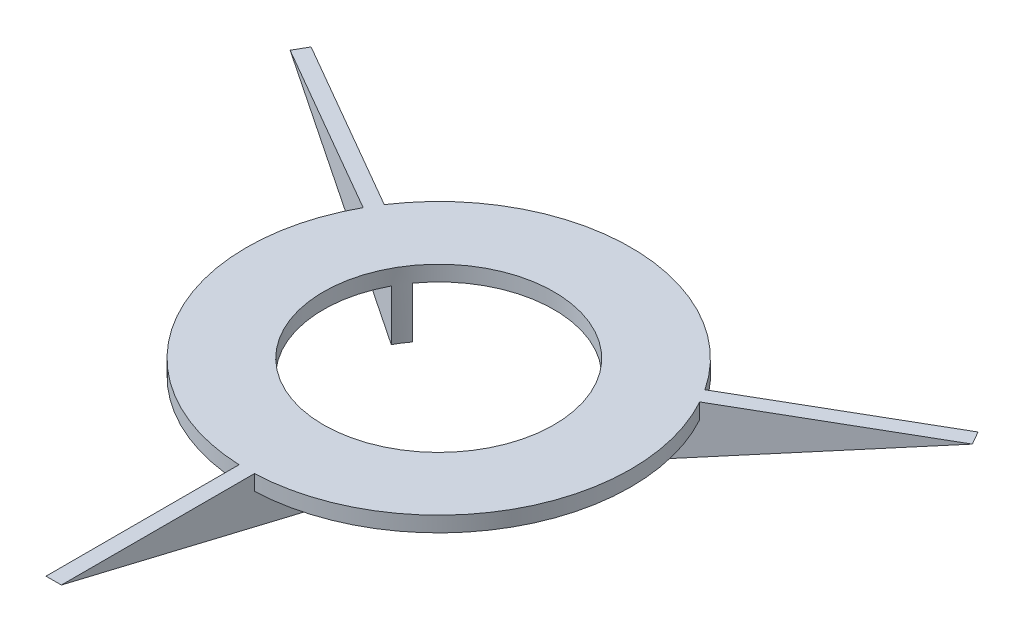
ISO-10303-21;
HEADER;
FILE_DESCRIPTION(('STEP AP214'),'2;1');
FILE_NAME('part.step','',(''),(''),'','','');
FILE_SCHEMA(('AUTOMOTIVE_DESIGN { 1 0 10303 214 1 1 1 1 }'));
ENDSEC;
DATA;
#1=APPLICATION_CONTEXT('core data for automotive mechanical design processes');
#2=APPLICATION_PROTOCOL_DEFINITION('international standard','automotive_design',2000,#1);
#3=PRODUCT_CONTEXT('',#1,'mechanical');
#4=PRODUCT('Part','Part','',(#3));
#5=PRODUCT_RELATED_PRODUCT_CATEGORY('part','',(#4));
#6=PRODUCT_DEFINITION_FORMATION('','',#4);
#7=PRODUCT_DEFINITION_CONTEXT('part definition',#1,'design');
#8=PRODUCT_DEFINITION('design','',#6,#7);
#9=PRODUCT_DEFINITION_SHAPE('','',#8);
#10=(LENGTH_UNIT() NAMED_UNIT(*) SI_UNIT(.MILLI.,.METRE.));
#11=(NAMED_UNIT(*) PLANE_ANGLE_UNIT() SI_UNIT($,.RADIAN.));
#12=(NAMED_UNIT(*) SI_UNIT($,.STERADIAN.) SOLID_ANGLE_UNIT());
#13=UNCERTAINTY_MEASURE_WITH_UNIT(LENGTH_MEASURE(1.E-05),#10,'distance_accuracy_value','');
#14=(GEOMETRIC_REPRESENTATION_CONTEXT(3) GLOBAL_UNCERTAINTY_ASSIGNED_CONTEXT((#13)) GLOBAL_UNIT_ASSIGNED_CONTEXT((#10,
#11,#12)) REPRESENTATION_CONTEXT('',''));
#15=CARTESIAN_POINT('',(0.,0.,0.));
#16=DIRECTION('',(0.,0.,1.));
#17=DIRECTION('',(1.,0.,0.));
#18=AXIS2_PLACEMENT_3D('',#15,#16,#17);
#19=CARTESIAN_POINT('',(0.,15.24,0.));
#20=DIRECTION('',(0.,-1.,0.));
#21=DIRECTION('',(0.,0.,-1.));
#22=AXIS2_PLACEMENT_3D('',#19,#20,#21);
#23=PLANE('',#22);
#24=DIRECTION('',(-0.866025403784443,0.,-0.499999999999992));
#25=VECTOR('',#24,1.);
#26=CARTESIAN_POINT('',(-1.26999999999999,15.24,0.));
#27=LINE('',#26,#25);
#28=CARTESIAN_POINT('',(-27.8083067588059,15.24,-15.3218985510331));
#29=VERTEX_POINT('',#28);
#30=CARTESIAN_POINT('',(-56.3725983665928,15.24,-31.8134999999995));
#31=VERTEX_POINT('',#30);
#32=EDGE_CURVE('E208',#29,#31,#27,.T.);
#33=ORIENTED_EDGE('',*,*,#32,.F.);
#34=CARTESIAN_POINT('',(0.,15.24,0.));
#35=DIRECTION('',(0.,1.,0.));
#36=DIRECTION('',(0.,0.,1.));
#37=AXIS2_PLACEMENT_3D('',#34,#35,#36);
#38=CIRCLE('',#37,31.75);
#39=CARTESIAN_POINT('',(-1.27,15.24,31.7245898318639));
#40=VERTEX_POINT('',#39);
#41=EDGE_CURVE('E164',#29,#40,#38,.T.);
#42=ORIENTED_EDGE('',*,*,#41,.T.);
#43=DIRECTION('',(0.,0.,1.));
#44=VECTOR('',#43,1.);
#45=CARTESIAN_POINT('',(-1.27,15.24,0.));
#46=LINE('',#45,#44);
#47=CARTESIAN_POINT('',(-1.27,15.24,63.627));
#48=VERTEX_POINT('',#47);
#49=EDGE_CURVE('E230',#40,#48,#46,.T.);
#50=ORIENTED_EDGE('',*,*,#49,.T.);
#51=DIRECTION('',(-1.,0.,0.));
#52=VECTOR('',#51,1.);
#53=CARTESIAN_POINT('',(1.27,15.24,63.627));
#54=LINE('',#53,#52);
#55=CARTESIAN_POINT('',(1.27,15.24,63.627));
#56=VERTEX_POINT('',#55);
#57=EDGE_CURVE('E235',#56,#48,#54,.T.);
#58=ORIENTED_EDGE('',*,*,#57,.F.);
#59=DIRECTION('',(0.,0.,1.));
#60=VECTOR('',#59,1.);
#61=CARTESIAN_POINT('',(1.27,15.24,0.));
#62=LINE('',#61,#60);
#63=CARTESIAN_POINT('',(1.27,15.24,31.7245898318639));
#64=VERTEX_POINT('',#63);
#65=EDGE_CURVE('E231',#64,#56,#62,.T.);
#66=ORIENTED_EDGE('',*,*,#65,.F.);
#67=CARTESIAN_POINT('',(27.8083067588057,15.24,-15.3218985510335));
#68=VERTEX_POINT('',#67);
#69=EDGE_CURVE('E171',#64,#68,#38,.T.);
#70=ORIENTED_EDGE('',*,*,#69,.T.);
#71=DIRECTION('',(0.866025403784436,0.,-0.500000000000004));
#72=VECTOR('',#71,1.);
#73=CARTESIAN_POINT('',(1.27,15.24,0.));
#74=LINE('',#73,#72);
#75=CARTESIAN_POINT('',(56.3725983665923,15.24,-31.8135000000003));
#76=VERTEX_POINT('',#75);
#77=EDGE_CURVE('E216',#68,#76,#74,.T.);
#78=ORIENTED_EDGE('',*,*,#77,.T.);
#79=DIRECTION('',(0.500000000000004,0.,0.866025403784436));
#80=VECTOR('',#79,1.);
#81=CARTESIAN_POINT('',(55.1025983665923,15.24,-34.0132045256127));
#82=LINE('',#81,#80);
#83=CARTESIAN_POINT('',(55.1025983665923,15.24,-34.0132045256127));
#84=VERTEX_POINT('',#83);
#85=EDGE_CURVE('E224',#84,#76,#82,.T.);
#86=ORIENTED_EDGE('',*,*,#85,.F.);
#87=DIRECTION('',(0.866025403784436,0.,-0.500000000000004));
#88=VECTOR('',#87,1.);
#89=CARTESIAN_POINT('',(0.,15.24,-2.19970452561247));
#90=LINE('',#89,#88);
#91=CARTESIAN_POINT('',(26.4942685939528,15.24,-17.4961776303136));
#92=VERTEX_POINT('',#91);
#93=EDGE_CURVE('E218',#92,#84,#90,.T.);
#94=ORIENTED_EDGE('',*,*,#93,.F.);
#95=CARTESIAN_POINT('',(-26.4942685939531,15.24,-17.4961776303132));
#96=VERTEX_POINT('',#95);
#97=EDGE_CURVE('E169',#92,#96,#38,.T.);
#98=ORIENTED_EDGE('',*,*,#97,.T.);
#99=DIRECTION('',(-0.866025403784443,0.,-0.499999999999992));
#100=VECTOR('',#99,1.);
#101=CARTESIAN_POINT('',(0.,15.24,-2.19970452561247));
#102=LINE('',#101,#100);
#103=CARTESIAN_POINT('',(-55.1025983665928,15.24,-34.013204525612));
#104=VERTEX_POINT('',#103);
#105=EDGE_CURVE('E204',#96,#104,#102,.T.);
#106=ORIENTED_EDGE('',*,*,#105,.T.);
#107=DIRECTION('',(0.499999999999992,0.,-0.866025403784443));
#108=VECTOR('',#107,1.);
#109=CARTESIAN_POINT('',(-56.3725983665928,15.24,-31.8134999999995));
#110=LINE('',#109,#108);
#111=EDGE_CURVE('E205',#31,#104,#110,.T.);
#112=ORIENTED_EDGE('',*,*,#111,.F.);
#113=EDGE_LOOP('',(#33,#42,#50,#58,#66,#70,#78,#86,#94,#98,#106,#112));
#114=FACE_BOUND('',#113,.T.);
#115=CARTESIAN_POINT('',(0.,15.24,0.));
#116=DIRECTION('',(0.,1.,0.));
#117=DIRECTION('',(0.,0.,1.));
#118=AXIS2_PLACEMENT_3D('',#115,#116,#117);
#119=CIRCLE('',#118,19.05);
#120=CARTESIAN_POINT('',(0.,15.24,19.05));
#121=VERTEX_POINT('',#120);
#122=EDGE_CURVE('E147',#121,#121,#119,.T.);
#123=ORIENTED_EDGE('',*,*,#122,.F.);
#124=EDGE_LOOP('',(#123));
#125=FACE_BOUND('',#124,.T.);
#126=ADVANCED_FACE('F39',(#114,#125),#23,.F.);
#127=CARTESIAN_POINT('',(1.27,15.24,63.627));
#128=DIRECTION('',(0.,0.972492920409641,-0.232932436026261));
#129=DIRECTION('',(0.,0.232932436026261,0.972492920409641));
#130=AXIS2_PLACEMENT_3D('',#127,#128,#129);
#131=PLANE('',#130);
#132=DIRECTION('',(0.,-0.232932436026261,-0.972492920409641));
#133=VECTOR('',#132,1.);
#134=CARTESIAN_POINT('',(-1.27,15.24,63.627));
#135=LINE('',#134,#133);
#136=CARTESIAN_POINT('',(-1.27,4.55272323947583,19.0076195248116));
#137=VERTEX_POINT('',#136);
#138=EDGE_CURVE('E233',#48,#137,#135,.T.);
#139=ORIENTED_EDGE('',*,*,#138,.T.);
#140=CARTESIAN_POINT('',(0.,0.,0.));
#141=DIRECTION('',(0.,0.972492920409641,-0.232932436026261));
#142=DIRECTION('',(0.,0.232932436026261,0.972492920409641));
#143=AXIS2_PLACEMENT_3D('',#140,#141,#142);
#144=ELLIPSE('',#143,19.5888315484864,19.05);
#145=CARTESIAN_POINT('',(1.27,4.55272323947584,19.0076195248116));
#146=VERTEX_POINT('',#145);
#147=EDGE_CURVE('E148',#137,#146,#144,.T.);
#148=ORIENTED_EDGE('',*,*,#147,.T.);
#149=DIRECTION('',(0.,-0.232932436026261,-0.972492920409641));
#150=VECTOR('',#149,1.);
#151=CARTESIAN_POINT('',(1.27,15.24,63.627));
#152=LINE('',#151,#150);
#153=EDGE_CURVE('E143',#56,#146,#152,.T.);
#154=ORIENTED_EDGE('',*,*,#153,.F.);
#155=ORIENTED_EDGE('',*,*,#57,.T.);
#156=EDGE_LOOP('',(#139,#148,#154,#155));
#157=FACE_BOUND('',#156,.T.);
#158=ADVANCED_FACE('F275',(#157),#131,.F.);
#159=CARTESIAN_POINT('',(1.27,0.,0.));
#160=DIRECTION('',(-1.,0.,0.));
#161=DIRECTION('',(0.,0.,1.));
#162=AXIS2_PLACEMENT_3D('',#159,#160,#161);
#163=PLANE('',#162);
#164=ORIENTED_EDGE('',*,*,#153,.T.);
#165=DIRECTION('',(0.,1.,0.));
#166=VECTOR('',#165,1.);
#167=CARTESIAN_POINT('',(1.27,0.,19.0076195248116));
#168=LINE('',#167,#166);
#169=CARTESIAN_POINT('',(1.27,12.7,19.0076195248116));
#170=VERTEX_POINT('',#169);
#171=EDGE_CURVE('E140',#146,#170,#168,.T.);
#172=ORIENTED_EDGE('',*,*,#171,.T.);
#173=DIRECTION('',(0.,0.,-1.));
#174=VECTOR('',#173,1.);
#175=CARTESIAN_POINT('',(1.27,12.7,0.));
#176=LINE('',#175,#174);
#177=CARTESIAN_POINT('',(1.27,12.7,31.7245898318639));
#178=VERTEX_POINT('',#177);
#179=EDGE_CURVE('E53',#178,#170,#176,.T.);
#180=ORIENTED_EDGE('',*,*,#179,.F.);
#181=DIRECTION('',(0.,1.,0.));
#182=VECTOR('',#181,1.);
#183=CARTESIAN_POINT('',(1.27,12.7,31.7245898318639));
#184=LINE('',#183,#182);
#185=EDGE_CURVE('E57',#178,#64,#184,.T.);
#186=ORIENTED_EDGE('',*,*,#185,.T.);
#187=ORIENTED_EDGE('',*,*,#65,.T.);
#188=EDGE_LOOP('',(#164,#172,#180,#186,#187));
#189=FACE_BOUND('',#188,.T.);
#190=ADVANCED_FACE('F141',(#189),#163,.F.);
#191=CARTESIAN_POINT('',(-1.27,0.,0.));
#192=DIRECTION('',(-1.,0.,0.));
#193=DIRECTION('',(0.,0.,1.));
#194=AXIS2_PLACEMENT_3D('',#191,#192,#193);
#195=PLANE('',#194);
#196=DIRECTION('',(0.,1.,0.));
#197=VECTOR('',#196,1.);
#198=CARTESIAN_POINT('',(-1.27,0.,19.0076195248116));
#199=LINE('',#198,#197);
#200=CARTESIAN_POINT('',(-1.27,12.7,19.0076195248116));
#201=VERTEX_POINT('',#200);
#202=EDGE_CURVE('E276',#137,#201,#199,.T.);
#203=ORIENTED_EDGE('',*,*,#202,.F.);
#204=ORIENTED_EDGE('',*,*,#138,.F.);
#205=ORIENTED_EDGE('',*,*,#49,.F.);
#206=DIRECTION('',(0.,1.,0.));
#207=VECTOR('',#206,1.);
#208=CARTESIAN_POINT('',(-1.27,12.7,31.7245898318639));
#209=LINE('',#208,#207);
#210=CARTESIAN_POINT('',(-1.27,12.7,31.7245898318639));
#211=VERTEX_POINT('',#210);
#212=EDGE_CURVE('E201',#211,#40,#209,.T.);
#213=ORIENTED_EDGE('',*,*,#212,.F.);
#214=DIRECTION('',(0.,0.,-1.));
#215=VECTOR('',#214,1.);
#216=CARTESIAN_POINT('',(-1.27,12.7,0.));
#217=LINE('',#216,#215);
#218=EDGE_CURVE('E159',#211,#201,#217,.T.);
#219=ORIENTED_EDGE('',*,*,#218,.T.);
#220=EDGE_LOOP('',(#203,#204,#205,#213,#219));
#221=FACE_BOUND('',#220,.T.);
#222=ADVANCED_FACE('F268',(#221),#195,.T.);
#223=CARTESIAN_POINT('',(55.1025983665923,15.24,-34.0132045256127));
#224=DIRECTION('',(-0.201725406964135,0.972492920409641,0.116466218013131));
#225=DIRECTION('',(-0.979156418960265,-0.203107624694176,0.));
#226=AXIS2_PLACEMENT_3D('',#223,#224,#225);
#227=PLANE('',#226);
#228=DIRECTION('',(-0.842203574075265,-0.232932436026261,0.486246460204824));
#229=VECTOR('',#228,1.);
#230=CARTESIAN_POINT('',(56.3725983665923,15.24,-31.8135000000003));
#231=LINE('',#230,#229);
#232=CARTESIAN_POINT('',(16.8061159592004,4.29690094908053,-8.9697807312057));
#233=VERTEX_POINT('',#232);
#234=EDGE_CURVE('E221',#76,#233,#231,.T.);
#235=ORIENTED_EDGE('',*,*,#234,.T.);
#236=CARTESIAN_POINT('',(0.,-0.26343766773802,0.));
#237=DIRECTION('',(-0.201725406964135,0.972492920409641,0.116466218013131));
#238=DIRECTION('',(0.842203574075265,0.232932436026261,-0.486246460204824));
#239=AXIS2_PLACEMENT_3D('',#236,#237,#238);
#240=ELLIPSE('',#239,19.5888315484864,19.05);
#241=CARTESIAN_POINT('',(15.4625877624823,4.27656488959876,-11.12703373265));
#242=VERTEX_POINT('',#241);
#243=EDGE_CURVE('E280',#233,#242,#240,.T.);
#244=ORIENTED_EDGE('',*,*,#243,.T.);
#245=DIRECTION('',(-0.842203574075265,-0.232932436026261,0.486246460204824));
#246=VECTOR('',#245,1.);
#247=CARTESIAN_POINT('',(55.1025983665923,15.24,-34.0132045256127));
#248=LINE('',#247,#246);
#249=EDGE_CURVE('E220',#84,#242,#248,.T.);
#250=ORIENTED_EDGE('',*,*,#249,.F.);
#251=ORIENTED_EDGE('',*,*,#85,.T.);
#252=EDGE_LOOP('',(#235,#244,#250,#251));
#253=FACE_BOUND('',#252,.T.);
#254=ADVANCED_FACE('F315',(#253),#227,.F.);
#255=CARTESIAN_POINT('',(0.,0.,-2.19970452561247));
#256=DIRECTION('',(0.500000000000004,0.,0.866025403784436));
#257=DIRECTION('',(0.866025403784436,0.,-0.500000000000004));
#258=AXIS2_PLACEMENT_3D('',#255,#256,#257);
#259=PLANE('',#258);
#260=ORIENTED_EDGE('',*,*,#249,.T.);
#261=DIRECTION('',(0.,1.,0.));
#262=VECTOR('',#261,1.);
#263=CARTESIAN_POINT('',(15.4625877624824,0.,-11.12703373265));
#264=LINE('',#263,#262);
#265=CARTESIAN_POINT('',(15.4625877624824,12.7,-11.12703373265));
#266=VERTEX_POINT('',#265);
#267=EDGE_CURVE('E277',#242,#266,#264,.T.);
#268=ORIENTED_EDGE('',*,*,#267,.T.);
#269=DIRECTION('',(-0.866025403784436,0.,0.500000000000004));
#270=VECTOR('',#269,1.);
#271=CARTESIAN_POINT('',(0.,12.7,-2.19970452561247));
#272=LINE('',#271,#270);
#273=CARTESIAN_POINT('',(26.4942685939528,12.7,-17.4961776303136));
#274=VERTEX_POINT('',#273);
#275=EDGE_CURVE('E192',#274,#266,#272,.T.);
#276=ORIENTED_EDGE('',*,*,#275,.F.);
#277=DIRECTION('',(0.,1.,0.));
#278=VECTOR('',#277,1.);
#279=CARTESIAN_POINT('',(26.4942685939528,12.7,-17.4961776303136));
#280=LINE('',#279,#278);
#281=EDGE_CURVE('E199',#274,#92,#280,.T.);
#282=ORIENTED_EDGE('',*,*,#281,.T.);
#283=ORIENTED_EDGE('',*,*,#93,.T.);
#284=EDGE_LOOP('',(#260,#268,#276,#282,#283));
#285=FACE_BOUND('',#284,.T.);
#286=ADVANCED_FACE('F319',(#285),#259,.F.);
#287=CARTESIAN_POINT('',(1.27,0.,0.));
#288=DIRECTION('',(0.500000000000004,0.,0.866025403784436));
#289=DIRECTION('',(0.866025403784436,0.,-0.500000000000004));
#290=AXIS2_PLACEMENT_3D('',#287,#288,#289);
#291=PLANE('',#290);
#292=DIRECTION('',(0.,1.,0.));
#293=VECTOR('',#292,1.);
#294=CARTESIAN_POINT('',(16.8061159592004,0.,-8.9697807312057));
#295=LINE('',#294,#293);
#296=CARTESIAN_POINT('',(16.8061159592004,12.7,-8.9697807312057));
#297=VERTEX_POINT('',#296);
#298=EDGE_CURVE('E163',#233,#297,#295,.T.);
#299=ORIENTED_EDGE('',*,*,#298,.F.);
#300=ORIENTED_EDGE('',*,*,#234,.F.);
#301=ORIENTED_EDGE('',*,*,#77,.F.);
#302=DIRECTION('',(0.,1.,0.));
#303=VECTOR('',#302,1.);
#304=CARTESIAN_POINT('',(27.8083067588057,12.7,-15.3218985510335));
#305=LINE('',#304,#303);
#306=CARTESIAN_POINT('',(27.8083067588057,12.7,-15.3218985510335));
#307=VERTEX_POINT('',#306);
#308=EDGE_CURVE('E197',#307,#68,#305,.T.);
#309=ORIENTED_EDGE('',*,*,#308,.F.);
#310=DIRECTION('',(-0.866025403784436,0.,0.500000000000004));
#311=VECTOR('',#310,1.);
#312=CARTESIAN_POINT('',(1.27,12.7,0.));
#313=LINE('',#312,#311);
#314=EDGE_CURVE('E190',#307,#297,#313,.T.);
#315=ORIENTED_EDGE('',*,*,#314,.T.);
#316=EDGE_LOOP('',(#299,#300,#301,#309,#315));
#317=FACE_BOUND('',#316,.T.);
#318=ADVANCED_FACE('F321',(#317),#291,.T.);
#319=CARTESIAN_POINT('',(-56.3725983665928,15.24,-31.8134999999995));
#320=DIRECTION('',(0.201725406964137,0.972492920409641,0.116466218013129));
#321=DIRECTION('',(-0.979156418960265,0.203107624694178,0.));
#322=AXIS2_PLACEMENT_3D('',#319,#320,#321);
#323=PLANE('',#322);
#324=DIRECTION('',(0.842203574075272,-0.232932436026261,0.486246460204813));
#325=VECTOR('',#324,1.);
#326=CARTESIAN_POINT('',(-55.1025983665928,15.24,-34.013204525612));
#327=LINE('',#326,#325);
#328=CARTESIAN_POINT('',(-15.4625877624825,4.27656488959877,-11.1270337326498));
#329=VERTEX_POINT('',#328);
#330=EDGE_CURVE('E209',#104,#329,#327,.T.);
#331=ORIENTED_EDGE('',*,*,#330,.T.);
#332=CARTESIAN_POINT('',(0.,-0.263437667738016,0.));
#333=DIRECTION('',(0.201725406964137,0.972492920409641,0.116466218013129));
#334=DIRECTION('',(-0.842203574075272,0.232932436026261,-0.486246460204813));
#335=AXIS2_PLACEMENT_3D('',#332,#333,#334);
#336=ELLIPSE('',#335,19.5888315484864,19.05);
#337=CARTESIAN_POINT('',(-16.8061159592006,4.29690094908054,-8.96978073120548));
#338=VERTEX_POINT('',#337);
#339=EDGE_CURVE('E283',#329,#338,#336,.T.);
#340=ORIENTED_EDGE('',*,*,#339,.T.);
#341=DIRECTION('',(0.842203574075272,-0.232932436026261,0.486246460204813));
#342=VECTOR('',#341,1.);
#343=CARTESIAN_POINT('',(-56.3725983665928,15.24,-31.8134999999995));
#344=LINE('',#343,#342);
#345=EDGE_CURVE('E213',#31,#338,#344,.T.);
#346=ORIENTED_EDGE('',*,*,#345,.F.);
#347=ORIENTED_EDGE('',*,*,#111,.T.);
#348=EDGE_LOOP('',(#331,#340,#346,#347));
#349=FACE_BOUND('',#348,.T.);
#350=ADVANCED_FACE('F324',(#349),#323,.F.);
#351=CARTESIAN_POINT('',(-1.26999999999999,0.,0.));
#352=DIRECTION('',(0.499999999999992,0.,-0.866025403784443));
#353=DIRECTION('',(-0.866025403784443,0.,-0.499999999999992));
#354=AXIS2_PLACEMENT_3D('',#351,#352,#353);
#355=PLANE('',#354);
#356=ORIENTED_EDGE('',*,*,#345,.T.);
#357=DIRECTION('',(0.,1.,0.));
#358=VECTOR('',#357,1.);
#359=CARTESIAN_POINT('',(-16.8061159592005,0.,-8.96978073120547));
#360=LINE('',#359,#358);
#361=CARTESIAN_POINT('',(-16.8061159592005,12.7,-8.96978073120547));
#362=VERTEX_POINT('',#361);
#363=EDGE_CURVE('E286',#338,#362,#360,.T.);
#364=ORIENTED_EDGE('',*,*,#363,.T.);
#365=DIRECTION('',(0.866025403784443,0.,0.499999999999992));
#366=VECTOR('',#365,1.);
#367=CARTESIAN_POINT('',(-1.26999999999999,12.7,0.));
#368=LINE('',#367,#366);
#369=CARTESIAN_POINT('',(-27.8083067588059,12.7,-15.3218985510331));
#370=VERTEX_POINT('',#369);
#371=EDGE_CURVE('E184',#370,#362,#368,.T.);
#372=ORIENTED_EDGE('',*,*,#371,.F.);
#373=DIRECTION('',(0.,1.,0.));
#374=VECTOR('',#373,1.);
#375=CARTESIAN_POINT('',(-27.8083067588059,12.7,-15.3218985510331));
#376=LINE('',#375,#374);
#377=EDGE_CURVE('E158',#370,#29,#376,.T.);
#378=ORIENTED_EDGE('',*,*,#377,.T.);
#379=ORIENTED_EDGE('',*,*,#32,.T.);
#380=EDGE_LOOP('',(#356,#364,#372,#378,#379));
#381=FACE_BOUND('',#380,.T.);
#382=ADVANCED_FACE('F291',(#381),#355,.F.);
#383=CARTESIAN_POINT('',(0.,0.,-2.19970452561247));
#384=DIRECTION('',(0.499999999999992,0.,-0.866025403784443));
#385=DIRECTION('',(-0.866025403784443,0.,-0.499999999999992));
#386=AXIS2_PLACEMENT_3D('',#383,#384,#385);
#387=PLANE('',#386);
#388=DIRECTION('',(0.,1.,0.));
#389=VECTOR('',#388,1.);
#390=CARTESIAN_POINT('',(-15.4625877624825,0.,-11.1270337326498));
#391=LINE('',#390,#389);
#392=CARTESIAN_POINT('',(-15.4625877624825,12.7,-11.1270337326498));
#393=VERTEX_POINT('',#392);
#394=EDGE_CURVE('E246',#329,#393,#391,.T.);
#395=ORIENTED_EDGE('',*,*,#394,.F.);
#396=ORIENTED_EDGE('',*,*,#330,.F.);
#397=ORIENTED_EDGE('',*,*,#105,.F.);
#398=DIRECTION('',(0.,1.,0.));
#399=VECTOR('',#398,1.);
#400=CARTESIAN_POINT('',(-26.4942685939531,12.7,-17.4961776303132));
#401=LINE('',#400,#399);
#402=CARTESIAN_POINT('',(-26.4942685939531,12.7,-17.4961776303132));
#403=VERTEX_POINT('',#402);
#404=EDGE_CURVE('E11',#403,#96,#401,.T.);
#405=ORIENTED_EDGE('',*,*,#404,.F.);
#406=DIRECTION('',(0.866025403784443,0.,0.499999999999992));
#407=VECTOR('',#406,1.);
#408=CARTESIAN_POINT('',(0.,12.7,-2.19970452561247));
#409=LINE('',#408,#407);
#410=EDGE_CURVE('E46',#403,#393,#409,.T.);
#411=ORIENTED_EDGE('',*,*,#410,.T.);
#412=EDGE_LOOP('',(#395,#396,#397,#405,#411));
#413=FACE_BOUND('',#412,.T.);
#414=ADVANCED_FACE('F244',(#413),#387,.T.);
#415=CARTESIAN_POINT('',(0.,12.7,0.));
#416=DIRECTION('',(0.,1.,0.));
#417=DIRECTION('',(0.,0.,1.));
#418=AXIS2_PLACEMENT_3D('',#415,#416,#417);
#419=PLANE('',#418);
#420=CARTESIAN_POINT('',(0.,12.7,0.));
#421=DIRECTION('',(0.,1.,0.));
#422=DIRECTION('',(0.,0.,1.));
#423=AXIS2_PLACEMENT_3D('',#420,#421,#422);
#424=CIRCLE('',#423,31.75);
#425=EDGE_CURVE('E185',#274,#403,#424,.T.);
#426=ORIENTED_EDGE('',*,*,#425,.F.);
#427=ORIENTED_EDGE('',*,*,#275,.T.);
#428=CARTESIAN_POINT('',(0.,12.7,0.));
#429=DIRECTION('',(0.,1.,0.));
#430=DIRECTION('',(0.,0.,1.));
#431=AXIS2_PLACEMENT_3D('',#428,#429,#430);
#432=CIRCLE('',#431,19.05);
#433=EDGE_CURVE('E165',#266,#393,#432,.T.);
#434=ORIENTED_EDGE('',*,*,#433,.T.);
#435=ORIENTED_EDGE('',*,*,#410,.F.);
#436=EDGE_LOOP('',(#426,#427,#434,#435));
#437=FACE_BOUND('',#436,.T.);
#438=ADVANCED_FACE('F251',(#437),#419,.F.);
#439=CARTESIAN_POINT('',(0.,12.7,0.));
#440=DIRECTION('',(0.,1.,0.));
#441=DIRECTION('',(0.,0.,1.));
#442=AXIS2_PLACEMENT_3D('',#439,#440,#441);
#443=CYLINDRICAL_SURFACE('',#442,31.75);
#444=ORIENTED_EDGE('',*,*,#281,.F.);
#445=ORIENTED_EDGE('',*,*,#425,.T.);
#446=ORIENTED_EDGE('',*,*,#404,.T.);
#447=ORIENTED_EDGE('',*,*,#97,.F.);
#448=EDGE_LOOP('',(#444,#445,#446,#447));
#449=FACE_BOUND('',#448,.T.);
#450=ADVANCED_FACE('F255',(#449),#443,.T.);
#451=ORIENTED_EDGE('',*,*,#218,.F.);
#452=EDGE_CURVE('E186',#370,#211,#424,.T.);
#453=ORIENTED_EDGE('',*,*,#452,.F.);
#454=ORIENTED_EDGE('',*,*,#371,.T.);
#455=EDGE_CURVE('E167',#362,#201,#432,.T.);
#456=ORIENTED_EDGE('',*,*,#455,.T.);
#457=EDGE_LOOP('',(#451,#453,#454,#456));
#458=FACE_BOUND('',#457,.T.);
#459=ADVANCED_FACE('F293',(#458),#419,.F.);
#460=ORIENTED_EDGE('',*,*,#452,.T.);
#461=ORIENTED_EDGE('',*,*,#212,.T.);
#462=ORIENTED_EDGE('',*,*,#41,.F.);
#463=ORIENTED_EDGE('',*,*,#377,.F.);
#464=EDGE_LOOP('',(#460,#461,#462,#463));
#465=FACE_BOUND('',#464,.T.);
#466=ADVANCED_FACE('F263',(#465),#443,.T.);
#467=ORIENTED_EDGE('',*,*,#185,.F.);
#468=EDGE_CURVE('E157',#178,#307,#424,.T.);
#469=ORIENTED_EDGE('',*,*,#468,.T.);
#470=ORIENTED_EDGE('',*,*,#308,.T.);
#471=ORIENTED_EDGE('',*,*,#69,.F.);
#472=EDGE_LOOP('',(#467,#469,#470,#471));
#473=FACE_BOUND('',#472,.T.);
#474=ADVANCED_FACE('F300',(#473),#443,.T.);
#475=ORIENTED_EDGE('',*,*,#468,.F.);
#476=ORIENTED_EDGE('',*,*,#179,.T.);
#477=EDGE_CURVE('E154',#170,#297,#432,.T.);
#478=ORIENTED_EDGE('',*,*,#477,.T.);
#479=ORIENTED_EDGE('',*,*,#314,.F.);
#480=EDGE_LOOP('',(#475,#476,#478,#479));
#481=FACE_BOUND('',#480,.T.);
#482=ADVANCED_FACE('F153',(#481),#419,.F.);
#483=CARTESIAN_POINT('',(0.,12.7,0.));
#484=DIRECTION('',(0.,1.,0.));
#485=DIRECTION('',(0.,0.,1.));
#486=AXIS2_PLACEMENT_3D('',#483,#484,#485);
#487=CYLINDRICAL_SURFACE('',#486,19.05);
#488=ORIENTED_EDGE('',*,*,#122,.T.);
#489=EDGE_LOOP('',(#488));
#490=FACE_BOUND('',#489,.T.);
#491=ORIENTED_EDGE('',*,*,#477,.F.);
#492=ORIENTED_EDGE('',*,*,#171,.F.);
#493=ORIENTED_EDGE('',*,*,#147,.F.);
#494=ORIENTED_EDGE('',*,*,#202,.T.);
#495=ORIENTED_EDGE('',*,*,#455,.F.);
#496=ORIENTED_EDGE('',*,*,#363,.F.);
#497=ORIENTED_EDGE('',*,*,#339,.F.);
#498=ORIENTED_EDGE('',*,*,#394,.T.);
#499=ORIENTED_EDGE('',*,*,#433,.F.);
#500=ORIENTED_EDGE('',*,*,#267,.F.);
#501=ORIENTED_EDGE('',*,*,#243,.F.);
#502=ORIENTED_EDGE('',*,*,#298,.T.);
#503=EDGE_LOOP('',(#491,#492,#493,#494,#495,#496,#497,#498,#499,#500,#501,#502));
#504=FACE_BOUND('',#503,.T.);
#505=ADVANCED_FACE('F161',(#490,#504),#487,.F.);
#506=CLOSED_SHELL('',(#126,#158,#190,#222,#254,#286,#318,#350,#382,#414,#438,#450,#459,#466,
#474,#482,#505));
#507=MANIFOLD_SOLID_BREP('B2',#506);
#508=ADVANCED_BREP_SHAPE_REPRESENTATION('',(#18,#507),#14);
#509=SHAPE_DEFINITION_REPRESENTATION(#9,#508);
ENDSEC;
END-ISO-10303-21;
